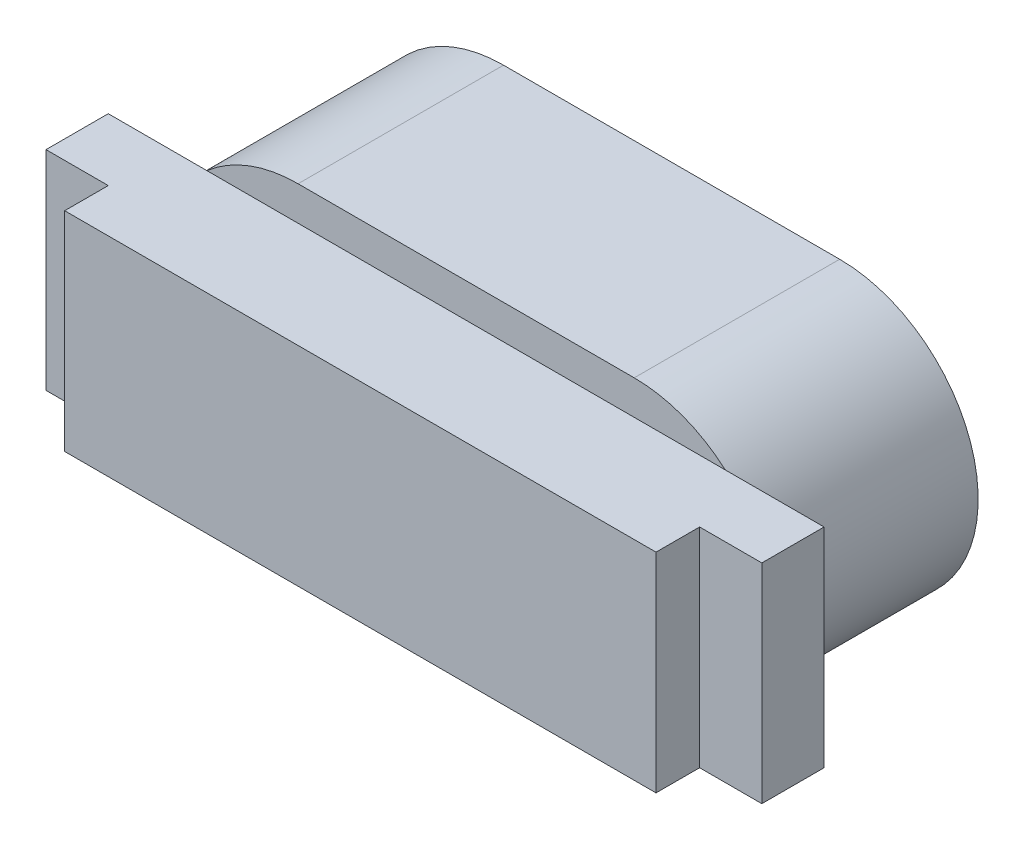
ISO-10303-21;
HEADER;
FILE_DESCRIPTION(('STEP AP214'),'2;1');
FILE_NAME('part.step','',(''),(''),'','','');
FILE_SCHEMA(('AUTOMOTIVE_DESIGN { 1 0 10303 214 1 1 1 1 }'));
ENDSEC;
DATA;
#1=APPLICATION_CONTEXT('core data for automotive mechanical design processes');
#2=APPLICATION_PROTOCOL_DEFINITION('international standard','automotive_design',2000,#1);
#3=PRODUCT_CONTEXT('',#1,'mechanical');
#4=PRODUCT('Part','Part','',(#3));
#5=PRODUCT_RELATED_PRODUCT_CATEGORY('part','',(#4));
#6=PRODUCT_DEFINITION_FORMATION('','',#4);
#7=PRODUCT_DEFINITION_CONTEXT('part definition',#1,'design');
#8=PRODUCT_DEFINITION('design','',#6,#7);
#9=PRODUCT_DEFINITION_SHAPE('','',#8);
#10=(LENGTH_UNIT() NAMED_UNIT(*) SI_UNIT(.MILLI.,.METRE.));
#11=(NAMED_UNIT(*) PLANE_ANGLE_UNIT() SI_UNIT($,.RADIAN.));
#12=(NAMED_UNIT(*) SI_UNIT($,.STERADIAN.) SOLID_ANGLE_UNIT());
#13=UNCERTAINTY_MEASURE_WITH_UNIT(LENGTH_MEASURE(1.E-05),#10,'distance_accuracy_value','');
#14=(GEOMETRIC_REPRESENTATION_CONTEXT(3) GLOBAL_UNCERTAINTY_ASSIGNED_CONTEXT((#13)) GLOBAL_UNIT_ASSIGNED_CONTEXT((#10,
#11,#12)) REPRESENTATION_CONTEXT('',''));
#15=CARTESIAN_POINT('',(0.,0.,0.));
#16=DIRECTION('',(0.,0.,1.));
#17=DIRECTION('',(1.,0.,0.));
#18=AXIS2_PLACEMENT_3D('',#15,#16,#17);
#19=CARTESIAN_POINT('',(0.,0.,4.3));
#20=DIRECTION('',(0.,0.,1.));
#21=DIRECTION('',(1.,0.,0.));
#22=AXIS2_PLACEMENT_3D('',#19,#20,#21);
#23=PLANE('',#22);
#24=DIRECTION('',(0.,1.,0.));
#25=VECTOR('',#24,1.);
#26=CARTESIAN_POINT('',(4.75,-1.675,4.3));
#27=LINE('',#26,#25);
#28=CARTESIAN_POINT('',(4.75,-1.675,4.3));
#29=VERTEX_POINT('',#28);
#30=CARTESIAN_POINT('',(4.75,1.675,4.3));
#31=VERTEX_POINT('',#30);
#32=EDGE_CURVE('E52',#29,#31,#27,.T.);
#33=ORIENTED_EDGE('',*,*,#32,.F.);
#34=DIRECTION('',(1.,0.,0.));
#35=VECTOR('',#34,1.);
#36=CARTESIAN_POINT('',(-5.75,-1.675,4.3));
#37=LINE('',#36,#35);
#38=CARTESIAN_POINT('',(5.75,-1.675,4.3));
#39=VERTEX_POINT('',#38);
#40=EDGE_CURVE('E185',#29,#39,#37,.T.);
#41=ORIENTED_EDGE('',*,*,#40,.T.);
#42=DIRECTION('',(0.,1.,0.));
#43=VECTOR('',#42,1.);
#44=CARTESIAN_POINT('',(5.75,1.675,4.3));
#45=LINE('',#44,#43);
#46=CARTESIAN_POINT('',(5.75,1.675,4.3));
#47=VERTEX_POINT('',#46);
#48=EDGE_CURVE('E180',#39,#47,#45,.T.);
#49=ORIENTED_EDGE('',*,*,#48,.T.);
#50=DIRECTION('',(-1.,0.,0.));
#51=VECTOR('',#50,1.);
#52=CARTESIAN_POINT('',(-5.75,1.675,4.3));
#53=LINE('',#52,#51);
#54=EDGE_CURVE('E205',#47,#31,#53,.T.);
#55=ORIENTED_EDGE('',*,*,#54,.T.);
#56=EDGE_LOOP('',(#33,#41,#49,#55));
#57=FACE_BOUND('',#56,.T.);
#58=ADVANCED_FACE('F33',(#57),#23,.T.);
#59=CARTESIAN_POINT('',(-2.7,0.,3.3));
#60=DIRECTION('',(0.,0.,1.));
#61=DIRECTION('',(1.,0.,0.));
#62=AXIS2_PLACEMENT_3D('',#59,#60,#61);
#63=PLANE('',#62);
#64=DIRECTION('',(1.,0.,0.));
#65=VECTOR('',#64,1.);
#66=CARTESIAN_POINT('',(-5.75,-1.675,3.3));
#67=LINE('',#66,#65);
#68=CARTESIAN_POINT('',(-4.16458185158768,-1.675,3.3));
#69=VERTEX_POINT('',#68);
#70=CARTESIAN_POINT('',(4.16458185158768,-1.675,3.3));
#71=VERTEX_POINT('',#70);
#72=EDGE_CURVE('E11',#69,#71,#67,.T.);
#73=ORIENTED_EDGE('',*,*,#72,.F.);
#74=CARTESIAN_POINT('',(-2.7,0.,3.3));
#75=DIRECTION('',(0.,0.,1.));
#76=DIRECTION('',(1.,0.,0.));
#77=AXIS2_PLACEMENT_3D('',#74,#75,#76);
#78=CIRCLE('',#77,2.225);
#79=CARTESIAN_POINT('',(-2.7,-2.225,3.3));
#80=VERTEX_POINT('',#79);
#81=EDGE_CURVE('E232',#69,#80,#78,.T.);
#82=ORIENTED_EDGE('',*,*,#81,.T.);
#83=DIRECTION('',(1.,0.,0.));
#84=VECTOR('',#83,1.);
#85=CARTESIAN_POINT('',(-2.7,-2.225,3.3));
#86=LINE('',#85,#84);
#87=CARTESIAN_POINT('',(2.7,-2.225,3.3));
#88=VERTEX_POINT('',#87);
#89=EDGE_CURVE('E247',#80,#88,#86,.T.);
#90=ORIENTED_EDGE('',*,*,#89,.T.);
#91=CARTESIAN_POINT('',(2.7,0.,3.3));
#92=DIRECTION('',(0.,0.,1.));
#93=DIRECTION('',(1.,0.,0.));
#94=AXIS2_PLACEMENT_3D('',#91,#92,#93);
#95=CIRCLE('',#94,2.225);
#96=EDGE_CURVE('E242',#88,#71,#95,.T.);
#97=ORIENTED_EDGE('',*,*,#96,.T.);
#98=EDGE_LOOP('',(#73,#82,#90,#97));
#99=FACE_BOUND('',#98,.T.);
#100=ADVANCED_FACE('F284',(#99),#63,.T.);
#101=CARTESIAN_POINT('',(-2.7,0.,3.3));
#102=DIRECTION('',(0.,0.,-1.));
#103=DIRECTION('',(-1.,0.,0.));
#104=AXIS2_PLACEMENT_3D('',#101,#102,#103);
#105=CYLINDRICAL_SURFACE('',#104,2.225);
#106=CARTESIAN_POINT('',(-2.7,0.,0.));
#107=DIRECTION('',(0.,0.,1.));
#108=DIRECTION('',(1.,0.,0.));
#109=AXIS2_PLACEMENT_3D('',#106,#107,#108);
#110=CIRCLE('',#109,2.225);
#111=CARTESIAN_POINT('',(-2.7,2.225,0.));
#112=VERTEX_POINT('',#111);
#113=CARTESIAN_POINT('',(-2.7,-2.225,0.));
#114=VERTEX_POINT('',#113);
#115=EDGE_CURVE('E237',#112,#114,#110,.T.);
#116=ORIENTED_EDGE('',*,*,#115,.T.);
#117=DIRECTION('',(0.,0.,-1.));
#118=VECTOR('',#117,1.);
#119=CARTESIAN_POINT('',(-2.7,-2.225,3.3));
#120=LINE('',#119,#118);
#121=EDGE_CURVE('E217',#80,#114,#120,.T.);
#122=ORIENTED_EDGE('',*,*,#121,.F.);
#123=ORIENTED_EDGE('',*,*,#81,.F.);
#124=CARTESIAN_POINT('',(-4.16458185158768,1.675,3.3));
#125=VERTEX_POINT('',#124);
#126=EDGE_CURVE('E251',#125,#69,#78,.T.);
#127=ORIENTED_EDGE('',*,*,#126,.F.);
#128=CARTESIAN_POINT('',(-2.7,2.225,3.3));
#129=VERTEX_POINT('',#128);
#130=EDGE_CURVE('E249',#129,#125,#78,.T.);
#131=ORIENTED_EDGE('',*,*,#130,.F.);
#132=DIRECTION('',(0.,0.,-1.));
#133=VECTOR('',#132,1.);
#134=CARTESIAN_POINT('',(-2.7,2.225,3.3));
#135=LINE('',#134,#133);
#136=EDGE_CURVE('E226',#129,#112,#135,.T.);
#137=ORIENTED_EDGE('',*,*,#136,.T.);
#138=EDGE_LOOP('',(#116,#122,#123,#127,#131,#137));
#139=FACE_BOUND('',#138,.T.);
#140=ADVANCED_FACE('F35',(#139),#105,.T.);
#141=CARTESIAN_POINT('',(-2.7,-2.225,3.3));
#142=DIRECTION('',(0.,1.,0.));
#143=DIRECTION('',(0.,0.,1.));
#144=AXIS2_PLACEMENT_3D('',#141,#142,#143);
#145=PLANE('',#144);
#146=DIRECTION('',(1.,0.,0.));
#147=VECTOR('',#146,1.);
#148=CARTESIAN_POINT('',(-2.7,-2.225,0.));
#149=LINE('',#148,#147);
#150=CARTESIAN_POINT('',(2.7,-2.225,0.));
#151=VERTEX_POINT('',#150);
#152=EDGE_CURVE('E235',#114,#151,#149,.T.);
#153=ORIENTED_EDGE('',*,*,#152,.T.);
#154=DIRECTION('',(0.,0.,-1.));
#155=VECTOR('',#154,1.);
#156=CARTESIAN_POINT('',(2.7,-2.225,3.3));
#157=LINE('',#156,#155);
#158=EDGE_CURVE('E220',#88,#151,#157,.T.);
#159=ORIENTED_EDGE('',*,*,#158,.F.);
#160=ORIENTED_EDGE('',*,*,#89,.F.);
#161=ORIENTED_EDGE('',*,*,#121,.T.);
#162=EDGE_LOOP('',(#153,#159,#160,#161));
#163=FACE_BOUND('',#162,.T.);
#164=ADVANCED_FACE('F312',(#163),#145,.F.);
#165=CARTESIAN_POINT('',(2.7,0.,3.3));
#166=DIRECTION('',(0.,0.,-1.));
#167=DIRECTION('',(-1.,0.,0.));
#168=AXIS2_PLACEMENT_3D('',#165,#166,#167);
#169=CYLINDRICAL_SURFACE('',#168,2.225);
#170=CARTESIAN_POINT('',(2.7,0.,0.));
#171=DIRECTION('',(0.,0.,1.));
#172=DIRECTION('',(1.,0.,0.));
#173=AXIS2_PLACEMENT_3D('',#170,#171,#172);
#174=CIRCLE('',#173,2.225);
#175=CARTESIAN_POINT('',(2.7,2.225,0.));
#176=VERTEX_POINT('',#175);
#177=EDGE_CURVE('E233',#151,#176,#174,.T.);
#178=ORIENTED_EDGE('',*,*,#177,.T.);
#179=DIRECTION('',(0.,0.,-1.));
#180=VECTOR('',#179,1.);
#181=CARTESIAN_POINT('',(2.7,2.225,3.3));
#182=LINE('',#181,#180);
#183=CARTESIAN_POINT('',(2.7,2.225,3.3));
#184=VERTEX_POINT('',#183);
#185=EDGE_CURVE('E223',#184,#176,#182,.T.);
#186=ORIENTED_EDGE('',*,*,#185,.F.);
#187=CARTESIAN_POINT('',(4.16458185158768,1.675,3.3));
#188=VERTEX_POINT('',#187);
#189=EDGE_CURVE('E246',#188,#184,#95,.T.);
#190=ORIENTED_EDGE('',*,*,#189,.F.);
#191=EDGE_CURVE('E245',#71,#188,#95,.T.);
#192=ORIENTED_EDGE('',*,*,#191,.F.);
#193=ORIENTED_EDGE('',*,*,#96,.F.);
#194=ORIENTED_EDGE('',*,*,#158,.T.);
#195=EDGE_LOOP('',(#178,#186,#190,#192,#193,#194));
#196=FACE_BOUND('',#195,.T.);
#197=ADVANCED_FACE('F274',(#196),#169,.T.);
#198=CARTESIAN_POINT('',(-2.7,2.225,3.3));
#199=DIRECTION('',(0.,-1.,0.));
#200=DIRECTION('',(0.,0.,-1.));
#201=AXIS2_PLACEMENT_3D('',#198,#199,#200);
#202=PLANE('',#201);
#203=DIRECTION('',(-1.,0.,0.));
#204=VECTOR('',#203,1.);
#205=CARTESIAN_POINT('',(-2.7,2.225,0.));
#206=LINE('',#205,#204);
#207=EDGE_CURVE('E230',#176,#112,#206,.T.);
#208=ORIENTED_EDGE('',*,*,#207,.T.);
#209=ORIENTED_EDGE('',*,*,#136,.F.);
#210=DIRECTION('',(-1.,0.,0.));
#211=VECTOR('',#210,1.);
#212=CARTESIAN_POINT('',(-2.7,2.225,3.3));
#213=LINE('',#212,#211);
#214=EDGE_CURVE('E229',#184,#129,#213,.T.);
#215=ORIENTED_EDGE('',*,*,#214,.F.);
#216=ORIENTED_EDGE('',*,*,#185,.T.);
#217=EDGE_LOOP('',(#208,#209,#215,#216));
#218=FACE_BOUND('',#217,.T.);
#219=ADVANCED_FACE('F317',(#218),#202,.F.);
#220=DIRECTION('',(-1.,0.,0.));
#221=VECTOR('',#220,1.);
#222=CARTESIAN_POINT('',(-5.75,1.675,3.3));
#223=LINE('',#222,#221);
#224=EDGE_CURVE('E42',#188,#125,#223,.T.);
#225=ORIENTED_EDGE('',*,*,#224,.F.);
#226=ORIENTED_EDGE('',*,*,#189,.T.);
#227=ORIENTED_EDGE('',*,*,#214,.T.);
#228=ORIENTED_EDGE('',*,*,#130,.T.);
#229=EDGE_LOOP('',(#225,#226,#227,#228));
#230=FACE_BOUND('',#229,.T.);
#231=ADVANCED_FACE('F268',(#230),#63,.T.);
#232=CARTESIAN_POINT('',(-2.7,0.,0.));
#233=DIRECTION('',(0.,0.,1.));
#234=DIRECTION('',(1.,0.,0.));
#235=AXIS2_PLACEMENT_3D('',#232,#233,#234);
#236=PLANE('',#235);
#237=ORIENTED_EDGE('',*,*,#115,.F.);
#238=ORIENTED_EDGE('',*,*,#207,.F.);
#239=ORIENTED_EDGE('',*,*,#177,.F.);
#240=ORIENTED_EDGE('',*,*,#152,.F.);
#241=EDGE_LOOP('',(#237,#238,#239,#240));
#242=FACE_BOUND('',#241,.T.);
#243=ADVANCED_FACE('F316',(#242),#236,.F.);
#244=CARTESIAN_POINT('',(0.,0.,3.3));
#245=DIRECTION('',(0.,0.,1.));
#246=DIRECTION('',(1.,0.,0.));
#247=AXIS2_PLACEMENT_3D('',#244,#245,#246);
#248=PLANE('',#247);
#249=CARTESIAN_POINT('',(-5.75,1.675,3.3));
#250=VERTEX_POINT('',#249);
#251=EDGE_CURVE('E163',#125,#250,#223,.T.);
#252=ORIENTED_EDGE('',*,*,#251,.F.);
#253=ORIENTED_EDGE('',*,*,#126,.T.);
#254=CARTESIAN_POINT('',(-5.75,-1.675,3.3));
#255=VERTEX_POINT('',#254);
#256=EDGE_CURVE('E44',#255,#69,#67,.T.);
#257=ORIENTED_EDGE('',*,*,#256,.F.);
#258=DIRECTION('',(0.,-1.,0.));
#259=VECTOR('',#258,1.);
#260=CARTESIAN_POINT('',(-5.75,1.675,3.3));
#261=LINE('',#260,#259);
#262=EDGE_CURVE('E261',#250,#255,#261,.T.);
#263=ORIENTED_EDGE('',*,*,#262,.F.);
#264=EDGE_LOOP('',(#252,#253,#257,#263));
#265=FACE_BOUND('',#264,.T.);
#266=ADVANCED_FACE('F290',(#265),#248,.F.);
#267=CARTESIAN_POINT('',(5.75,-1.675,3.3));
#268=VERTEX_POINT('',#267);
#269=EDGE_CURVE('E45',#71,#268,#67,.T.);
#270=ORIENTED_EDGE('',*,*,#269,.F.);
#271=ORIENTED_EDGE('',*,*,#191,.T.);
#272=CARTESIAN_POINT('',(5.75,1.675,3.3));
#273=VERTEX_POINT('',#272);
#274=EDGE_CURVE('E262',#273,#188,#223,.T.);
#275=ORIENTED_EDGE('',*,*,#274,.F.);
#276=DIRECTION('',(0.,1.,0.));
#277=VECTOR('',#276,1.);
#278=CARTESIAN_POINT('',(5.75,1.675,3.3));
#279=LINE('',#278,#277);
#280=EDGE_CURVE('E160',#268,#273,#279,.T.);
#281=ORIENTED_EDGE('',*,*,#280,.F.);
#282=EDGE_LOOP('',(#270,#271,#275,#281));
#283=FACE_BOUND('',#282,.T.);
#284=ADVANCED_FACE('F279',(#283),#248,.F.);
#285=CARTESIAN_POINT('',(5.75,1.675,4.3));
#286=DIRECTION('',(-1.,0.,0.));
#287=DIRECTION('',(0.,-1.,0.));
#288=AXIS2_PLACEMENT_3D('',#285,#286,#287);
#289=PLANE('',#288);
#290=ORIENTED_EDGE('',*,*,#280,.T.);
#291=DIRECTION('',(0.,0.,-1.));
#292=VECTOR('',#291,1.);
#293=CARTESIAN_POINT('',(5.75,1.675,4.3));
#294=LINE('',#293,#292);
#295=EDGE_CURVE('E240',#47,#273,#294,.T.);
#296=ORIENTED_EDGE('',*,*,#295,.F.);
#297=ORIENTED_EDGE('',*,*,#48,.F.);
#298=DIRECTION('',(0.,0.,-1.));
#299=VECTOR('',#298,1.);
#300=CARTESIAN_POINT('',(5.75,-1.675,4.3));
#301=LINE('',#300,#299);
#302=EDGE_CURVE('E200',#39,#268,#301,.T.);
#303=ORIENTED_EDGE('',*,*,#302,.T.);
#304=EDGE_LOOP('',(#290,#296,#297,#303));
#305=FACE_BOUND('',#304,.T.);
#306=ADVANCED_FACE('F369',(#305),#289,.F.);
#307=CARTESIAN_POINT('',(-5.75,1.675,4.3));
#308=DIRECTION('',(0.,-1.,0.));
#309=DIRECTION('',(0.,0.,-1.));
#310=AXIS2_PLACEMENT_3D('',#307,#308,#309);
#311=PLANE('',#310);
#312=ORIENTED_EDGE('',*,*,#274,.T.);
#313=ORIENTED_EDGE('',*,*,#224,.T.);
#314=ORIENTED_EDGE('',*,*,#251,.T.);
#315=DIRECTION('',(0.,0.,-1.));
#316=VECTOR('',#315,1.);
#317=CARTESIAN_POINT('',(-5.75,1.675,4.3));
#318=LINE('',#317,#316);
#319=CARTESIAN_POINT('',(-5.75,1.675,4.3));
#320=VERTEX_POINT('',#319);
#321=EDGE_CURVE('E254',#320,#250,#318,.T.);
#322=ORIENTED_EDGE('',*,*,#321,.F.);
#323=CARTESIAN_POINT('',(-4.75,1.675,4.3));
#324=VERTEX_POINT('',#323);
#325=EDGE_CURVE('E209',#324,#320,#53,.T.);
#326=ORIENTED_EDGE('',*,*,#325,.F.);
#327=DIRECTION('',(0.,0.,-1.));
#328=VECTOR('',#327,1.);
#329=CARTESIAN_POINT('',(-4.75,1.675,5.));
#330=LINE('',#329,#328);
#331=CARTESIAN_POINT('',(-4.75,1.675,5.));
#332=VERTEX_POINT('',#331);
#333=EDGE_CURVE('E145',#332,#324,#330,.T.);
#334=ORIENTED_EDGE('',*,*,#333,.F.);
#335=DIRECTION('',(-1.,0.,0.));
#336=VECTOR('',#335,1.);
#337=CARTESIAN_POINT('',(-4.75,1.675,5.));
#338=LINE('',#337,#336);
#339=CARTESIAN_POINT('',(4.75,1.675,5.));
#340=VERTEX_POINT('',#339);
#341=EDGE_CURVE('E138',#340,#332,#338,.T.);
#342=ORIENTED_EDGE('',*,*,#341,.F.);
#343=DIRECTION('',(0.,0.,-1.));
#344=VECTOR('',#343,1.);
#345=CARTESIAN_POINT('',(4.75,1.675,5.));
#346=LINE('',#345,#344);
#347=EDGE_CURVE('E143',#340,#31,#346,.T.);
#348=ORIENTED_EDGE('',*,*,#347,.T.);
#349=ORIENTED_EDGE('',*,*,#54,.F.);
#350=ORIENTED_EDGE('',*,*,#295,.T.);
#351=EDGE_LOOP('',(#312,#313,#314,#322,#326,#334,#342,#348,#349,#350));
#352=FACE_BOUND('',#351,.T.);
#353=ADVANCED_FACE('F141',(#352),#311,.F.);
#354=CARTESIAN_POINT('',(-5.75,1.675,4.3));
#355=DIRECTION('',(1.,0.,0.));
#356=DIRECTION('',(0.,0.,-1.));
#357=AXIS2_PLACEMENT_3D('',#354,#355,#356);
#358=PLANE('',#357);
#359=ORIENTED_EDGE('',*,*,#262,.T.);
#360=DIRECTION('',(0.,0.,-1.));
#361=VECTOR('',#360,1.);
#362=CARTESIAN_POINT('',(-5.75,-1.675,4.3));
#363=LINE('',#362,#361);
#364=CARTESIAN_POINT('',(-5.75,-1.675,4.3));
#365=VERTEX_POINT('',#364);
#366=EDGE_CURVE('E257',#365,#255,#363,.T.);
#367=ORIENTED_EDGE('',*,*,#366,.F.);
#368=DIRECTION('',(0.,-1.,0.));
#369=VECTOR('',#368,1.);
#370=CARTESIAN_POINT('',(-5.75,1.675,4.3));
#371=LINE('',#370,#369);
#372=EDGE_CURVE('E204',#320,#365,#371,.T.);
#373=ORIENTED_EDGE('',*,*,#372,.F.);
#374=ORIENTED_EDGE('',*,*,#321,.T.);
#375=EDGE_LOOP('',(#359,#367,#373,#374));
#376=FACE_BOUND('',#375,.T.);
#377=ADVANCED_FACE('F293',(#376),#358,.F.);
#378=CARTESIAN_POINT('',(-5.75,-1.675,4.3));
#379=DIRECTION('',(0.,1.,0.));
#380=DIRECTION('',(0.,0.,1.));
#381=AXIS2_PLACEMENT_3D('',#378,#379,#380);
#382=PLANE('',#381);
#383=ORIENTED_EDGE('',*,*,#256,.T.);
#384=ORIENTED_EDGE('',*,*,#72,.T.);
#385=ORIENTED_EDGE('',*,*,#269,.T.);
#386=ORIENTED_EDGE('',*,*,#302,.F.);
#387=ORIENTED_EDGE('',*,*,#40,.F.);
#388=DIRECTION('',(0.,0.,-1.));
#389=VECTOR('',#388,1.);
#390=CARTESIAN_POINT('',(4.75,-1.675,5.));
#391=LINE('',#390,#389);
#392=CARTESIAN_POINT('',(4.75,-1.675,5.));
#393=VERTEX_POINT('',#392);
#394=EDGE_CURVE('E173',#393,#29,#391,.T.);
#395=ORIENTED_EDGE('',*,*,#394,.F.);
#396=DIRECTION('',(1.,0.,0.));
#397=VECTOR('',#396,1.);
#398=CARTESIAN_POINT('',(-4.75,-1.675,5.));
#399=LINE('',#398,#397);
#400=CARTESIAN_POINT('',(-4.75,-1.675,5.));
#401=VERTEX_POINT('',#400);
#402=EDGE_CURVE('E154',#401,#393,#399,.T.);
#403=ORIENTED_EDGE('',*,*,#402,.F.);
#404=DIRECTION('',(0.,0.,-1.));
#405=VECTOR('',#404,1.);
#406=CARTESIAN_POINT('',(-4.75,-1.675,5.));
#407=LINE('',#406,#405);
#408=CARTESIAN_POINT('',(-4.75,-1.675,4.3));
#409=VERTEX_POINT('',#408);
#410=EDGE_CURVE('E165',#401,#409,#407,.T.);
#411=ORIENTED_EDGE('',*,*,#410,.T.);
#412=EDGE_CURVE('E203',#365,#409,#37,.T.);
#413=ORIENTED_EDGE('',*,*,#412,.F.);
#414=ORIENTED_EDGE('',*,*,#366,.T.);
#415=EDGE_LOOP('',(#383,#384,#385,#386,#387,#395,#403,#411,#413,#414));
#416=FACE_BOUND('',#415,.T.);
#417=ADVANCED_FACE('F197',(#416),#382,.F.);
#418=DIRECTION('',(0.,-1.,0.));
#419=VECTOR('',#418,1.);
#420=CARTESIAN_POINT('',(-4.75,-1.675,4.3));
#421=LINE('',#420,#419);
#422=EDGE_CURVE('E60',#324,#409,#421,.T.);
#423=ORIENTED_EDGE('',*,*,#422,.F.);
#424=ORIENTED_EDGE('',*,*,#325,.T.);
#425=ORIENTED_EDGE('',*,*,#372,.T.);
#426=ORIENTED_EDGE('',*,*,#412,.T.);
#427=EDGE_LOOP('',(#423,#424,#425,#426));
#428=FACE_BOUND('',#427,.T.);
#429=ADVANCED_FACE('F294',(#428),#23,.T.);
#430=CARTESIAN_POINT('',(4.75,-1.675,5.));
#431=DIRECTION('',(-1.,0.,0.));
#432=DIRECTION('',(0.,0.,1.));
#433=AXIS2_PLACEMENT_3D('',#430,#431,#432);
#434=PLANE('',#433);
#435=ORIENTED_EDGE('',*,*,#32,.T.);
#436=ORIENTED_EDGE('',*,*,#347,.F.);
#437=DIRECTION('',(0.,1.,0.));
#438=VECTOR('',#437,1.);
#439=CARTESIAN_POINT('',(4.75,-1.675,5.));
#440=LINE('',#439,#438);
#441=EDGE_CURVE('E149',#393,#340,#440,.T.);
#442=ORIENTED_EDGE('',*,*,#441,.F.);
#443=ORIENTED_EDGE('',*,*,#394,.T.);
#444=EDGE_LOOP('',(#435,#436,#442,#443));
#445=FACE_BOUND('',#444,.T.);
#446=ADVANCED_FACE('F159',(#445),#434,.F.);
#447=CARTESIAN_POINT('',(-4.75,-1.675,5.));
#448=DIRECTION('',(1.,0.,0.));
#449=DIRECTION('',(0.,0.,-1.));
#450=AXIS2_PLACEMENT_3D('',#447,#448,#449);
#451=PLANE('',#450);
#452=ORIENTED_EDGE('',*,*,#422,.T.);
#453=ORIENTED_EDGE('',*,*,#410,.F.);
#454=DIRECTION('',(0.,-1.,0.));
#455=VECTOR('',#454,1.);
#456=CARTESIAN_POINT('',(-4.75,-1.675,5.));
#457=LINE('',#456,#455);
#458=EDGE_CURVE('E148',#332,#401,#457,.T.);
#459=ORIENTED_EDGE('',*,*,#458,.F.);
#460=ORIENTED_EDGE('',*,*,#333,.T.);
#461=EDGE_LOOP('',(#452,#453,#459,#460));
#462=FACE_BOUND('',#461,.T.);
#463=ADVANCED_FACE('F195',(#462),#451,.F.);
#464=CARTESIAN_POINT('',(0.,0.,5.));
#465=DIRECTION('',(0.,0.,-1.));
#466=DIRECTION('',(-1.,0.,0.));
#467=AXIS2_PLACEMENT_3D('',#464,#465,#466);
#468=PLANE('',#467);
#469=ORIENTED_EDGE('',*,*,#441,.T.);
#470=ORIENTED_EDGE('',*,*,#341,.T.);
#471=ORIENTED_EDGE('',*,*,#458,.T.);
#472=ORIENTED_EDGE('',*,*,#402,.T.);
#473=EDGE_LOOP('',(#469,#470,#471,#472));
#474=FACE_BOUND('',#473,.T.);
#475=ADVANCED_FACE('F152',(#474),#468,.F.);
#476=CLOSED_SHELL('',(#58,#100,#140,#164,#197,#219,#231,#243,#266,#284,#306,#353,#377,#417,#429,
#446,#463,#475));
#477=MANIFOLD_SOLID_BREP('B2',#476);
#478=ADVANCED_BREP_SHAPE_REPRESENTATION('',(#18,#477),#14);
#479=SHAPE_DEFINITION_REPRESENTATION(#9,#478);
ENDSEC;
END-ISO-10303-21;
